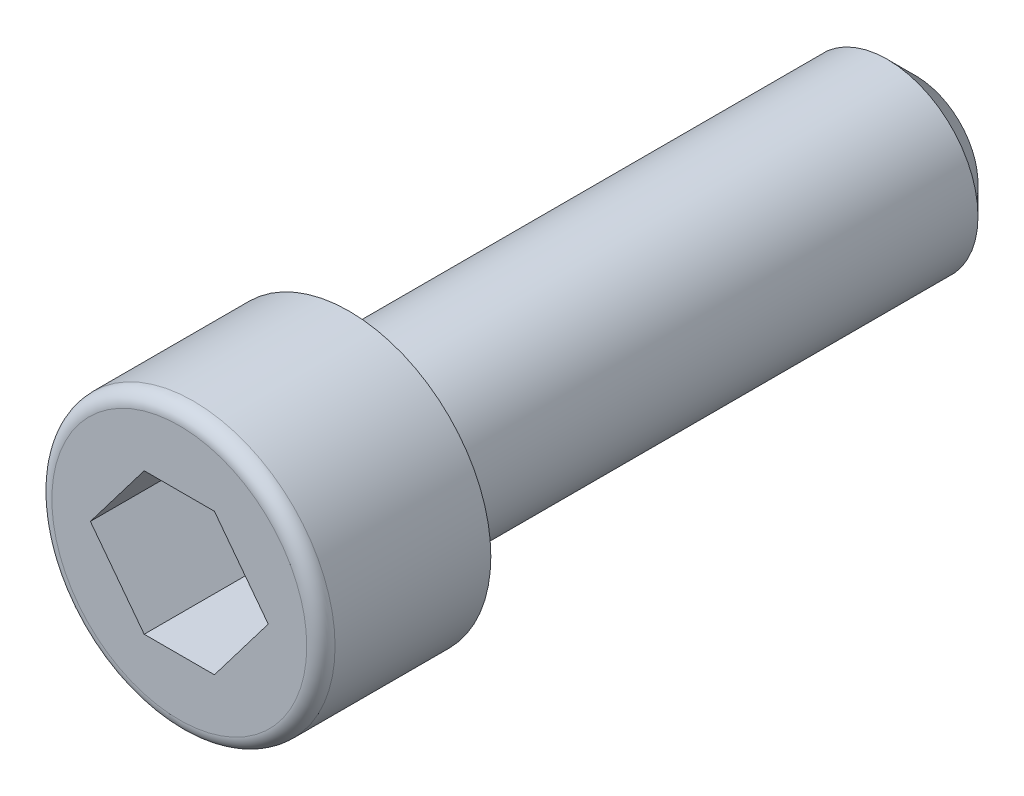
ISO-10303-21;
HEADER;
FILE_DESCRIPTION(('STEP AP214'),'2;1');
FILE_NAME('part.step','',(''),(''),'','','');
FILE_SCHEMA(('AUTOMOTIVE_DESIGN { 1 0 10303 214 1 1 1 1 }'));
ENDSEC;
DATA;
#1=APPLICATION_CONTEXT('core data for automotive mechanical design processes');
#2=APPLICATION_PROTOCOL_DEFINITION('international standard','automotive_design',2000,#1);
#3=PRODUCT_CONTEXT('',#1,'mechanical');
#4=PRODUCT('Part','Part','',(#3));
#5=PRODUCT_RELATED_PRODUCT_CATEGORY('part','',(#4));
#6=PRODUCT_DEFINITION_FORMATION('','',#4);
#7=PRODUCT_DEFINITION_CONTEXT('part definition',#1,'design');
#8=PRODUCT_DEFINITION('design','',#6,#7);
#9=PRODUCT_DEFINITION_SHAPE('','',#8);
#10=(LENGTH_UNIT() NAMED_UNIT(*) SI_UNIT(.MILLI.,.METRE.));
#11=(NAMED_UNIT(*) PLANE_ANGLE_UNIT() SI_UNIT($,.RADIAN.));
#12=(NAMED_UNIT(*) SI_UNIT($,.STERADIAN.) SOLID_ANGLE_UNIT());
#13=UNCERTAINTY_MEASURE_WITH_UNIT(LENGTH_MEASURE(1.E-05),#10,'distance_accuracy_value','');
#14=(GEOMETRIC_REPRESENTATION_CONTEXT(3) GLOBAL_UNCERTAINTY_ASSIGNED_CONTEXT((#13)) GLOBAL_UNIT_ASSIGNED_CONTEXT((#10,
#11,#12)) REPRESENTATION_CONTEXT('',''));
#15=CARTESIAN_POINT('',(0.,0.,0.));
#16=DIRECTION('',(0.,0.,1.));
#17=DIRECTION('',(1.,0.,0.));
#18=AXIS2_PLACEMENT_3D('',#15,#16,#17);
#19=CARTESIAN_POINT('',(0.,0.,0.));
#20=DIRECTION('',(0.,0.,1.));
#21=DIRECTION('',(1.,0.,0.));
#22=AXIS2_PLACEMENT_3D('',#19,#20,#21);
#23=PLANE('',#22);
#24=CARTESIAN_POINT('',(0.,0.,0.));
#25=DIRECTION('',(0.,0.,1.));
#26=DIRECTION('',(1.,0.,0.));
#27=AXIS2_PLACEMENT_3D('',#24,#25,#26);
#28=CIRCLE('',#27,5.);
#29=CARTESIAN_POINT('',(5.00000000000001,0.,0.));
#30=VERTEX_POINT('',#29);
#31=EDGE_CURVE('E142',#30,#30,#28,.T.);
#32=ORIENTED_EDGE('',*,*,#31,.F.);
#33=EDGE_LOOP('',(#32));
#34=FACE_BOUND('',#33,.T.);
#35=CARTESIAN_POINT('',(0.,0.,0.));
#36=DIRECTION('',(0.,0.,-1.));
#37=DIRECTION('',(-1.,0.,0.));
#38=AXIS2_PLACEMENT_3D('',#35,#36,#37);
#39=CIRCLE('',#38,3.20158040294037);
#40=CARTESIAN_POINT('',(-3.20158040294038,0.,0.));
#41=VERTEX_POINT('',#40);
#42=EDGE_CURVE('E143',#41,#41,#39,.T.);
#43=ORIENTED_EDGE('',*,*,#42,.F.);
#44=EDGE_LOOP('',(#43));
#45=FACE_BOUND('',#44,.T.);
#46=ADVANCED_FACE('F34',(#34,#45),#23,.F.);
#47=CARTESIAN_POINT('',(0.,0.,6.));
#48=DIRECTION('',(0.,0.,-1.));
#49=DIRECTION('',(-1.,0.,0.));
#50=AXIS2_PLACEMENT_3D('',#47,#48,#49);
#51=CYLINDRICAL_SURFACE('',#50,5.);
#52=CARTESIAN_POINT('',(0.,0.,5.5));
#53=DIRECTION('',(0.,0.,1.));
#54=DIRECTION('',(1.,0.,0.));
#55=AXIS2_PLACEMENT_3D('',#52,#53,#54);
#56=CIRCLE('',#55,5.);
#57=CARTESIAN_POINT('',(5.00000000000001,0.,5.5));
#58=VERTEX_POINT('',#57);
#59=EDGE_CURVE('E151',#58,#58,#56,.F.);
#60=ORIENTED_EDGE('',*,*,#59,.T.);
#61=EDGE_LOOP('',(#60));
#62=FACE_BOUND('',#61,.T.);
#63=ORIENTED_EDGE('',*,*,#31,.T.);
#64=EDGE_LOOP('',(#63));
#65=FACE_BOUND('',#64,.T.);
#66=ADVANCED_FACE('F36',(#62,#65),#51,.T.);
#67=CARTESIAN_POINT('',(0.,0.,6.));
#68=DIRECTION('',(0.,0.,1.));
#69=DIRECTION('',(1.,0.,0.));
#70=AXIS2_PLACEMENT_3D('',#67,#68,#69);
#71=PLANE('',#70);
#72=CARTESIAN_POINT('',(0.,0.,6.));
#73=DIRECTION('',(0.,0.,1.));
#74=DIRECTION('',(1.,0.,0.));
#75=AXIS2_PLACEMENT_3D('',#72,#73,#74);
#76=CIRCLE('',#75,4.5);
#77=CARTESIAN_POINT('',(4.50000000000001,0.,6.));
#78=VERTEX_POINT('',#77);
#79=EDGE_CURVE('E146',#78,#78,#76,.T.);
#80=ORIENTED_EDGE('',*,*,#79,.T.);
#81=EDGE_LOOP('',(#80));
#82=FACE_BOUND('',#81,.T.);
#83=DIRECTION('',(0.605083267533575,0.796162194123093,0.));
#84=VECTOR('',#83,1.);
#85=CARTESIAN_POINT('',(1.24006369362148,-2.49999999999999,6.));
#86=LINE('',#85,#84);
#87=CARTESIAN_POINT('',(1.24006369362148,-2.49999999999999,6.));
#88=VERTEX_POINT('',#87);
#89=CARTESIAN_POINT('',(3.14006369362154,0.,6.));
#90=VERTEX_POINT('',#89);
#91=EDGE_CURVE('E49',#88,#90,#86,.T.);
#92=ORIENTED_EDGE('',*,*,#91,.F.);
#93=DIRECTION('',(1.,0.,0.));
#94=VECTOR('',#93,1.);
#95=CARTESIAN_POINT('',(-1.24006369362148,-2.5,6.));
#96=LINE('',#95,#94);
#97=CARTESIAN_POINT('',(-1.24006369362148,-2.5,6.));
#98=VERTEX_POINT('',#97);
#99=EDGE_CURVE('E118',#98,#88,#96,.T.);
#100=ORIENTED_EDGE('',*,*,#99,.F.);
#101=DIRECTION('',(0.605083267533577,-0.796162194123093,0.));
#102=VECTOR('',#101,1.);
#103=CARTESIAN_POINT('',(-3.14006369362158,0.,6.));
#104=LINE('',#103,#102);
#105=CARTESIAN_POINT('',(-3.14006369362158,0.,6.));
#106=VERTEX_POINT('',#105);
#107=EDGE_CURVE('E112',#106,#98,#104,.T.);
#108=ORIENTED_EDGE('',*,*,#107,.F.);
#109=DIRECTION('',(-0.605083267533575,-0.796162194123093,0.));
#110=VECTOR('',#109,1.);
#111=CARTESIAN_POINT('',(-1.24006369362148,2.5,6.));
#112=LINE('',#111,#110);
#113=CARTESIAN_POINT('',(-1.24006369362148,2.5,6.));
#114=VERTEX_POINT('',#113);
#115=EDGE_CURVE('E110',#114,#106,#112,.T.);
#116=ORIENTED_EDGE('',*,*,#115,.F.);
#117=DIRECTION('',(-1.,0.,0.));
#118=VECTOR('',#117,1.);
#119=CARTESIAN_POINT('',(1.24006369362148,2.5,6.));
#120=LINE('',#119,#118);
#121=CARTESIAN_POINT('',(1.24006369362148,2.5,6.));
#122=VERTEX_POINT('',#121);
#123=EDGE_CURVE('E92',#122,#114,#120,.T.);
#124=ORIENTED_EDGE('',*,*,#123,.F.);
#125=DIRECTION('',(-0.605083267533577,0.796162194123093,0.));
#126=VECTOR('',#125,1.);
#127=CARTESIAN_POINT('',(3.14006369362154,0.,6.));
#128=LINE('',#127,#126);
#129=EDGE_CURVE('E103',#90,#122,#128,.T.);
#130=ORIENTED_EDGE('',*,*,#129,.F.);
#131=EDGE_LOOP('',(#92,#100,#108,#116,#124,#130));
#132=FACE_BOUND('',#131,.T.);
#133=ADVANCED_FACE('F107',(#82,#132),#71,.T.);
#134=CARTESIAN_POINT('',(0.,0.,-20.));
#135=DIRECTION('',(0.,0.,1.));
#136=DIRECTION('',(1.,0.,0.));
#137=AXIS2_PLACEMENT_3D('',#134,#135,#136);
#138=CYLINDRICAL_SURFACE('',#137,3.20158040294037);
#139=CARTESIAN_POINT('',(0.,0.,-19.));
#140=DIRECTION('',(0.,0.,-1.));
#141=DIRECTION('',(-1.,0.,0.));
#142=AXIS2_PLACEMENT_3D('',#139,#140,#141);
#143=CIRCLE('',#142,3.20158040294037);
#144=CARTESIAN_POINT('',(-3.20158040294038,0.,-19.));
#145=VERTEX_POINT('',#144);
#146=EDGE_CURVE('E11',#145,#145,#143,.F.);
#147=ORIENTED_EDGE('',*,*,#146,.T.);
#148=EDGE_LOOP('',(#147));
#149=FACE_BOUND('',#148,.T.);
#150=ORIENTED_EDGE('',*,*,#42,.T.);
#151=EDGE_LOOP('',(#150));
#152=FACE_BOUND('',#151,.T.);
#153=ADVANCED_FACE('F181',(#149,#152),#138,.T.);
#154=CARTESIAN_POINT('',(0.,0.,-20.));
#155=DIRECTION('',(0.,0.,-1.));
#156=DIRECTION('',(-1.,0.,0.));
#157=AXIS2_PLACEMENT_3D('',#154,#155,#156);
#158=PLANE('',#157);
#159=CARTESIAN_POINT('',(0.,0.,-20.));
#160=DIRECTION('',(0.,0.,-1.));
#161=DIRECTION('',(-1.,0.,0.));
#162=AXIS2_PLACEMENT_3D('',#159,#160,#161);
#163=CIRCLE('',#162,2.20158040294035);
#164=CARTESIAN_POINT('',(-2.20158040294036,0.,-20.));
#165=VERTEX_POINT('',#164);
#166=EDGE_CURVE('E42',#165,#165,#163,.T.);
#167=ORIENTED_EDGE('',*,*,#166,.T.);
#168=EDGE_LOOP('',(#167));
#169=FACE_BOUND('',#168,.T.);
#170=ADVANCED_FACE('F156',(#169),#158,.T.);
#171=CARTESIAN_POINT('',(1.24006369362148,-2.49999999999999,1.));
#172=DIRECTION('',(0.796162194123093,-0.605083267533576,0.));
#173=DIRECTION('',(0.605083267533575,0.796162194123093,0.));
#174=AXIS2_PLACEMENT_3D('',#171,#172,#173);
#175=PLANE('',#174);
#176=DIRECTION('',(0.,0.,1.));
#177=VECTOR('',#176,1.);
#178=CARTESIAN_POINT('',(1.24006369362148,-2.49999999999999,1.));
#179=LINE('',#178,#177);
#180=CARTESIAN_POINT('',(1.24006369362148,-2.49999999999999,1.));
#181=VERTEX_POINT('',#180);
#182=EDGE_CURVE('E56',#181,#88,#179,.T.);
#183=ORIENTED_EDGE('',*,*,#182,.T.);
#184=ORIENTED_EDGE('',*,*,#91,.T.);
#185=DIRECTION('',(0.,0.,1.));
#186=VECTOR('',#185,1.);
#187=CARTESIAN_POINT('',(3.14006369362154,0.,1.));
#188=LINE('',#187,#186);
#189=CARTESIAN_POINT('',(3.14006369362154,0.,1.));
#190=VERTEX_POINT('',#189);
#191=EDGE_CURVE('E100',#190,#90,#188,.T.);
#192=ORIENTED_EDGE('',*,*,#191,.F.);
#193=DIRECTION('',(0.605083267533575,0.796162194123093,0.));
#194=VECTOR('',#193,1.);
#195=CARTESIAN_POINT('',(1.24006369362148,-2.49999999999999,1.));
#196=LINE('',#195,#194);
#197=EDGE_CURVE('E120',#181,#190,#196,.T.);
#198=ORIENTED_EDGE('',*,*,#197,.F.);
#199=EDGE_LOOP('',(#183,#184,#192,#198));
#200=FACE_BOUND('',#199,.T.);
#201=ADVANCED_FACE('F187',(#200),#175,.F.);
#202=CARTESIAN_POINT('',(-1.24006369362148,-2.5,1.));
#203=DIRECTION('',(0.,-1.,0.));
#204=DIRECTION('',(0.,0.,-1.));
#205=AXIS2_PLACEMENT_3D('',#202,#203,#204);
#206=PLANE('',#205);
#207=DIRECTION('',(0.,0.,1.));
#208=VECTOR('',#207,1.);
#209=CARTESIAN_POINT('',(-1.24006369362148,-2.5,1.));
#210=LINE('',#209,#208);
#211=CARTESIAN_POINT('',(-1.24006369362148,-2.5,1.));
#212=VERTEX_POINT('',#211);
#213=EDGE_CURVE('E139',#212,#98,#210,.T.);
#214=ORIENTED_EDGE('',*,*,#213,.T.);
#215=ORIENTED_EDGE('',*,*,#99,.T.);
#216=ORIENTED_EDGE('',*,*,#182,.F.);
#217=DIRECTION('',(1.,0.,0.));
#218=VECTOR('',#217,1.);
#219=CARTESIAN_POINT('',(-1.24006369362148,-2.5,1.));
#220=LINE('',#219,#218);
#221=EDGE_CURVE('E132',#212,#181,#220,.T.);
#222=ORIENTED_EDGE('',*,*,#221,.F.);
#223=EDGE_LOOP('',(#214,#215,#216,#222));
#224=FACE_BOUND('',#223,.T.);
#225=ADVANCED_FACE('F196',(#224),#206,.F.);
#226=CARTESIAN_POINT('',(-3.14006369362158,0.,1.));
#227=DIRECTION('',(-0.796162194123093,-0.605083267533577,0.));
#228=DIRECTION('',(0.605083267533577,-0.796162194123093,0.));
#229=AXIS2_PLACEMENT_3D('',#226,#227,#228);
#230=PLANE('',#229);
#231=DIRECTION('',(0.,0.,1.));
#232=VECTOR('',#231,1.);
#233=CARTESIAN_POINT('',(-3.14006369362158,0.,1.));
#234=LINE('',#233,#232);
#235=CARTESIAN_POINT('',(-3.14006369362158,0.,1.));
#236=VERTEX_POINT('',#235);
#237=EDGE_CURVE('E137',#236,#106,#234,.T.);
#238=ORIENTED_EDGE('',*,*,#237,.T.);
#239=ORIENTED_EDGE('',*,*,#107,.T.);
#240=ORIENTED_EDGE('',*,*,#213,.F.);
#241=DIRECTION('',(0.605083267533577,-0.796162194123093,0.));
#242=VECTOR('',#241,1.);
#243=CARTESIAN_POINT('',(-3.14006369362158,0.,1.));
#244=LINE('',#243,#242);
#245=EDGE_CURVE('E129',#236,#212,#244,.T.);
#246=ORIENTED_EDGE('',*,*,#245,.F.);
#247=EDGE_LOOP('',(#238,#239,#240,#246));
#248=FACE_BOUND('',#247,.T.);
#249=ADVANCED_FACE('F201',(#248),#230,.F.);
#250=CARTESIAN_POINT('',(-1.24006369362148,2.5,1.));
#251=DIRECTION('',(-0.796162194123093,0.605083267533576,0.));
#252=DIRECTION('',(-0.605083267533575,-0.796162194123093,0.));
#253=AXIS2_PLACEMENT_3D('',#250,#251,#252);
#254=PLANE('',#253);
#255=DIRECTION('',(0.,0.,1.));
#256=VECTOR('',#255,1.);
#257=CARTESIAN_POINT('',(-1.24006369362148,2.5,1.));
#258=LINE('',#257,#256);
#259=CARTESIAN_POINT('',(-1.24006369362148,2.5,1.));
#260=VERTEX_POINT('',#259);
#261=EDGE_CURVE('E99',#260,#114,#258,.T.);
#262=ORIENTED_EDGE('',*,*,#261,.T.);
#263=ORIENTED_EDGE('',*,*,#115,.T.);
#264=ORIENTED_EDGE('',*,*,#237,.F.);
#265=DIRECTION('',(-0.605083267533575,-0.796162194123093,0.));
#266=VECTOR('',#265,1.);
#267=CARTESIAN_POINT('',(-1.24006369362148,2.5,1.));
#268=LINE('',#267,#266);
#269=EDGE_CURVE('E126',#260,#236,#268,.T.);
#270=ORIENTED_EDGE('',*,*,#269,.F.);
#271=EDGE_LOOP('',(#262,#263,#264,#270));
#272=FACE_BOUND('',#271,.T.);
#273=ADVANCED_FACE('F209',(#272),#254,.F.);
#274=CARTESIAN_POINT('',(1.24006369362148,2.5,1.));
#275=DIRECTION('',(0.,1.,0.));
#276=DIRECTION('',(0.,0.,1.));
#277=AXIS2_PLACEMENT_3D('',#274,#275,#276);
#278=PLANE('',#277);
#279=DIRECTION('',(0.,0.,1.));
#280=VECTOR('',#279,1.);
#281=CARTESIAN_POINT('',(1.24006369362148,2.5,1.));
#282=LINE('',#281,#280);
#283=CARTESIAN_POINT('',(1.24006369362148,2.5,1.));
#284=VERTEX_POINT('',#283);
#285=EDGE_CURVE('E88',#284,#122,#282,.T.);
#286=ORIENTED_EDGE('',*,*,#285,.T.);
#287=ORIENTED_EDGE('',*,*,#123,.T.);
#288=ORIENTED_EDGE('',*,*,#261,.F.);
#289=DIRECTION('',(-1.,0.,0.));
#290=VECTOR('',#289,1.);
#291=CARTESIAN_POINT('',(1.24006369362148,2.5,1.));
#292=LINE('',#291,#290);
#293=EDGE_CURVE('E95',#284,#260,#292,.T.);
#294=ORIENTED_EDGE('',*,*,#293,.F.);
#295=EDGE_LOOP('',(#286,#287,#288,#294));
#296=FACE_BOUND('',#295,.T.);
#297=ADVANCED_FACE('F90',(#296),#278,.F.);
#298=CARTESIAN_POINT('',(3.14006369362154,0.,1.));
#299=DIRECTION('',(0.796162194123093,0.605083267533577,0.));
#300=DIRECTION('',(-0.605083267533577,0.796162194123093,0.));
#301=AXIS2_PLACEMENT_3D('',#298,#299,#300);
#302=PLANE('',#301);
#303=DIRECTION('',(-0.605083267533577,0.796162194123093,0.));
#304=VECTOR('',#303,1.);
#305=CARTESIAN_POINT('',(3.14006369362154,0.,1.));
#306=LINE('',#305,#304);
#307=EDGE_CURVE('E123',#190,#284,#306,.T.);
#308=ORIENTED_EDGE('',*,*,#307,.F.);
#309=ORIENTED_EDGE('',*,*,#191,.T.);
#310=ORIENTED_EDGE('',*,*,#129,.T.);
#311=ORIENTED_EDGE('',*,*,#285,.F.);
#312=EDGE_LOOP('',(#308,#309,#310,#311));
#313=FACE_BOUND('',#312,.T.);
#314=ADVANCED_FACE('F104',(#313),#302,.F.);
#315=CARTESIAN_POINT('',(3.14006369362154,0.,1.));
#316=DIRECTION('',(0.,0.,1.));
#317=DIRECTION('',(1.,0.,0.));
#318=AXIS2_PLACEMENT_3D('',#315,#316,#317);
#319=PLANE('',#318);
#320=ORIENTED_EDGE('',*,*,#197,.T.);
#321=ORIENTED_EDGE('',*,*,#307,.T.);
#322=ORIENTED_EDGE('',*,*,#293,.T.);
#323=ORIENTED_EDGE('',*,*,#269,.T.);
#324=ORIENTED_EDGE('',*,*,#245,.T.);
#325=ORIENTED_EDGE('',*,*,#221,.T.);
#326=EDGE_LOOP('',(#320,#321,#322,#323,#324,#325));
#327=FACE_BOUND('',#326,.T.);
#328=ADVANCED_FACE('F166',(#327),#319,.T.);
#329=CARTESIAN_POINT('',(0.,0.,5.5));
#330=DIRECTION('',(0.,0.,1.));
#331=DIRECTION('',(1.,0.,0.));
#332=AXIS2_PLACEMENT_3D('',#329,#330,#331);
#333=TOROIDAL_SURFACE('',#332,4.5,0.5);
#334=ORIENTED_EDGE('',*,*,#59,.F.);
#335=EDGE_LOOP('',(#334));
#336=FACE_BOUND('',#335,.T.);
#337=ORIENTED_EDGE('',*,*,#79,.F.);
#338=EDGE_LOOP('',(#337));
#339=FACE_BOUND('',#338,.T.);
#340=ADVANCED_FACE('F160',(#336,#339),#333,.T.);
#341=CARTESIAN_POINT('',(0.,0.,-20.));
#342=DIRECTION('',(0.,0.,1.));
#343=DIRECTION('',(1.,0.,0.));
#344=AXIS2_PLACEMENT_3D('',#341,#342,#343);
#345=CONICAL_SURFACE('',#344,2.20158040294035,0.785398163397453);
#346=ORIENTED_EDGE('',*,*,#146,.F.);
#347=EDGE_LOOP('',(#346));
#348=FACE_BOUND('',#347,.T.);
#349=ORIENTED_EDGE('',*,*,#166,.F.);
#350=EDGE_LOOP('',(#349));
#351=FACE_BOUND('',#350,.T.);
#352=ADVANCED_FACE('F158',(#348,#351),#345,.T.);
#353=CLOSED_SHELL('',(#46,#66,#133,#153,#170,#201,#225,#249,#273,#297,#314,#328,#340,#352));
#354=MANIFOLD_SOLID_BREP('B2',#353);
#355=ADVANCED_BREP_SHAPE_REPRESENTATION('',(#18,#354),#14);
#356=SHAPE_DEFINITION_REPRESENTATION(#9,#355);
ENDSEC;
END-ISO-10303-21;
